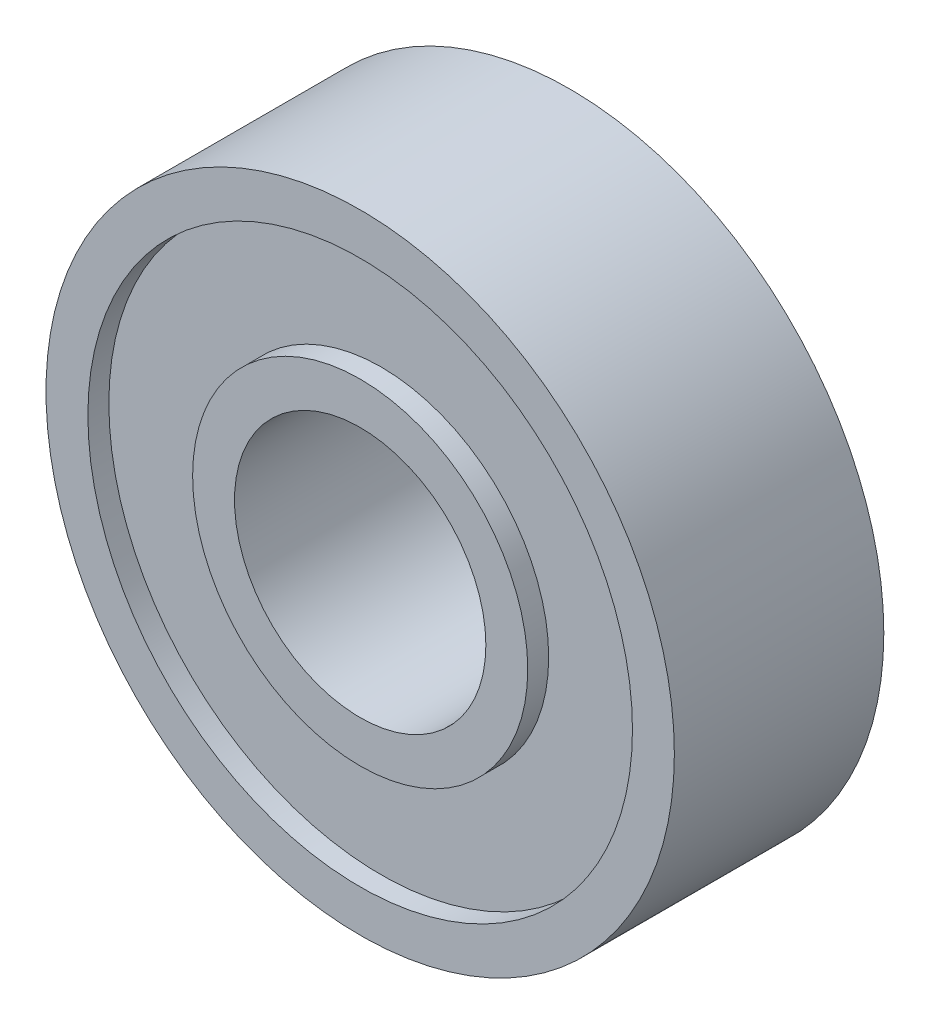
ISO-10303-21;
HEADER;
FILE_DESCRIPTION(('STEP AP214'),'2;1');
FILE_NAME('part.step','',(''),(''),'','','');
FILE_SCHEMA(('AUTOMOTIVE_DESIGN { 1 0 10303 214 1 1 1 1 }'));
ENDSEC;
DATA;
#1=APPLICATION_CONTEXT('core data for automotive mechanical design processes');
#2=APPLICATION_PROTOCOL_DEFINITION('international standard','automotive_design',2000,#1);
#3=PRODUCT_CONTEXT('',#1,'mechanical');
#4=PRODUCT('Part','Part','',(#3));
#5=PRODUCT_RELATED_PRODUCT_CATEGORY('part','',(#4));
#6=PRODUCT_DEFINITION_FORMATION('','',#4);
#7=PRODUCT_DEFINITION_CONTEXT('part definition',#1,'design');
#8=PRODUCT_DEFINITION('design','',#6,#7);
#9=PRODUCT_DEFINITION_SHAPE('','',#8);
#10=(LENGTH_UNIT() NAMED_UNIT(*) SI_UNIT(.MILLI.,.METRE.));
#11=(NAMED_UNIT(*) PLANE_ANGLE_UNIT() SI_UNIT($,.RADIAN.));
#12=(NAMED_UNIT(*) SI_UNIT($,.STERADIAN.) SOLID_ANGLE_UNIT());
#13=UNCERTAINTY_MEASURE_WITH_UNIT(LENGTH_MEASURE(1.E-05),#10,'distance_accuracy_value','');
#14=(GEOMETRIC_REPRESENTATION_CONTEXT(3) GLOBAL_UNCERTAINTY_ASSIGNED_CONTEXT((#13)) GLOBAL_UNIT_ASSIGNED_CONTEXT((#10,
#11,#12)) REPRESENTATION_CONTEXT('',''));
#15=CARTESIAN_POINT('',(0.,0.,0.));
#16=DIRECTION('',(0.,0.,1.));
#17=DIRECTION('',(1.,0.,0.));
#18=AXIS2_PLACEMENT_3D('',#15,#16,#17);
#19=CARTESIAN_POINT('',(0.,0.,0.));
#20=DIRECTION('',(0.,0.,1.));
#21=DIRECTION('',(1.,0.,0.));
#22=AXIS2_PLACEMENT_3D('',#19,#20,#21);
#23=PLANE('',#22);
#24=CARTESIAN_POINT('',(0.,0.,0.));
#25=DIRECTION('',(0.,0.,1.));
#26=DIRECTION('',(1.,0.,0.));
#27=AXIS2_PLACEMENT_3D('',#24,#25,#26);
#28=CIRCLE('',#27,3.);
#29=CARTESIAN_POINT('',(3.,0.,0.));
#30=VERTEX_POINT('',#29);
#31=EDGE_CURVE('E44',#30,#30,#28,.T.);
#32=ORIENTED_EDGE('',*,*,#31,.T.);
#33=EDGE_LOOP('',(#32));
#34=FACE_BOUND('',#33,.T.);
#35=CARTESIAN_POINT('',(0.,0.,0.));
#36=DIRECTION('',(0.,0.,1.));
#37=DIRECTION('',(1.,0.,0.));
#38=AXIS2_PLACEMENT_3D('',#35,#36,#37);
#39=CIRCLE('',#38,4.);
#40=CARTESIAN_POINT('',(4.,0.,0.));
#41=VERTEX_POINT('',#40);
#42=EDGE_CURVE('E68',#41,#41,#39,.T.);
#43=ORIENTED_EDGE('',*,*,#42,.F.);
#44=EDGE_LOOP('',(#43));
#45=FACE_BOUND('',#44,.T.);
#46=ADVANCED_FACE('F31',(#34,#45),#23,.F.);
#47=CARTESIAN_POINT('',(0.,0.,5.));
#48=DIRECTION('',(0.,0.,1.));
#49=DIRECTION('',(1.,0.,0.));
#50=AXIS2_PLACEMENT_3D('',#47,#48,#49);
#51=PLANE('',#50);
#52=CARTESIAN_POINT('',(0.,0.,5.));
#53=DIRECTION('',(0.,0.,1.));
#54=DIRECTION('',(1.,0.,0.));
#55=AXIS2_PLACEMENT_3D('',#52,#53,#54);
#56=CIRCLE('',#55,3.);
#57=CARTESIAN_POINT('',(3.,0.,5.));
#58=VERTEX_POINT('',#57);
#59=EDGE_CURVE('E42',#58,#58,#56,.T.);
#60=ORIENTED_EDGE('',*,*,#59,.F.);
#61=EDGE_LOOP('',(#60));
#62=FACE_BOUND('',#61,.T.);
#63=CARTESIAN_POINT('',(0.,0.,5.));
#64=DIRECTION('',(0.,0.,1.));
#65=DIRECTION('',(1.,0.,0.));
#66=AXIS2_PLACEMENT_3D('',#63,#64,#65);
#67=CIRCLE('',#66,4.);
#68=CARTESIAN_POINT('',(4.,0.,5.));
#69=VERTEX_POINT('',#68);
#70=EDGE_CURVE('E56',#69,#69,#67,.T.);
#71=ORIENTED_EDGE('',*,*,#70,.T.);
#72=EDGE_LOOP('',(#71));
#73=FACE_BOUND('',#72,.T.);
#74=ADVANCED_FACE('F84',(#62,#73),#51,.T.);
#75=CARTESIAN_POINT('',(0.,0.,5.));
#76=DIRECTION('',(0.,0.,1.));
#77=DIRECTION('',(1.,0.,0.));
#78=AXIS2_PLACEMENT_3D('',#75,#76,#77);
#79=CIRCLE('',#78,6.5);
#80=CARTESIAN_POINT('',(6.5,0.,5.));
#81=VERTEX_POINT('',#80);
#82=EDGE_CURVE('E50',#81,#81,#79,.T.);
#83=ORIENTED_EDGE('',*,*,#82,.F.);
#84=EDGE_LOOP('',(#83));
#85=FACE_BOUND('',#84,.T.);
#86=CARTESIAN_POINT('',(0.,0.,5.));
#87=DIRECTION('',(0.,0.,1.));
#88=DIRECTION('',(1.,0.,0.));
#89=AXIS2_PLACEMENT_3D('',#86,#87,#88);
#90=CIRCLE('',#89,7.5);
#91=CARTESIAN_POINT('',(7.5,0.,5.));
#92=VERTEX_POINT('',#91);
#93=EDGE_CURVE('E10',#92,#92,#90,.T.);
#94=ORIENTED_EDGE('',*,*,#93,.T.);
#95=EDGE_LOOP('',(#94));
#96=FACE_BOUND('',#95,.T.);
#97=ADVANCED_FACE('F90',(#85,#96),#51,.T.);
#98=CARTESIAN_POINT('',(0.,0.,0.));
#99=DIRECTION('',(0.,0.,1.));
#100=DIRECTION('',(1.,0.,0.));
#101=AXIS2_PLACEMENT_3D('',#98,#99,#100);
#102=CIRCLE('',#101,6.5);
#103=CARTESIAN_POINT('',(6.5,0.,0.));
#104=VERTEX_POINT('',#103);
#105=EDGE_CURVE('E62',#104,#104,#102,.T.);
#106=ORIENTED_EDGE('',*,*,#105,.T.);
#107=EDGE_LOOP('',(#106));
#108=FACE_BOUND('',#107,.T.);
#109=CARTESIAN_POINT('',(0.,0.,0.));
#110=DIRECTION('',(0.,0.,1.));
#111=DIRECTION('',(1.,0.,0.));
#112=AXIS2_PLACEMENT_3D('',#109,#110,#111);
#113=CIRCLE('',#112,7.5);
#114=CARTESIAN_POINT('',(7.5,0.,0.));
#115=VERTEX_POINT('',#114);
#116=EDGE_CURVE('E35',#115,#115,#113,.T.);
#117=ORIENTED_EDGE('',*,*,#116,.F.);
#118=EDGE_LOOP('',(#117));
#119=FACE_BOUND('',#118,.T.);
#120=ADVANCED_FACE('F86',(#108,#119),#23,.F.);
#121=CARTESIAN_POINT('',(0.,0.,5.));
#122=DIRECTION('',(0.,0.,-1.));
#123=DIRECTION('',(-1.,0.,0.));
#124=AXIS2_PLACEMENT_3D('',#121,#122,#123);
#125=CYLINDRICAL_SURFACE('',#124,7.5);
#126=ORIENTED_EDGE('',*,*,#93,.F.);
#127=EDGE_LOOP('',(#126));
#128=FACE_BOUND('',#127,.T.);
#129=ORIENTED_EDGE('',*,*,#116,.T.);
#130=EDGE_LOOP('',(#129));
#131=FACE_BOUND('',#130,.T.);
#132=ADVANCED_FACE('F33',(#128,#131),#125,.T.);
#133=CARTESIAN_POINT('',(0.,0.,5.));
#134=DIRECTION('',(0.,0.,-1.));
#135=DIRECTION('',(-1.,0.,0.));
#136=AXIS2_PLACEMENT_3D('',#133,#134,#135);
#137=CYLINDRICAL_SURFACE('',#136,3.);
#138=ORIENTED_EDGE('',*,*,#59,.T.);
#139=EDGE_LOOP('',(#138));
#140=FACE_BOUND('',#139,.T.);
#141=ORIENTED_EDGE('',*,*,#31,.F.);
#142=EDGE_LOOP('',(#141));
#143=FACE_BOUND('',#142,.T.);
#144=ADVANCED_FACE('F99',(#140,#143),#137,.F.);
#145=CARTESIAN_POINT('',(0.,0.,4.5));
#146=DIRECTION('',(0.,0.,1.));
#147=DIRECTION('',(1.,0.,0.));
#148=AXIS2_PLACEMENT_3D('',#145,#146,#147);
#149=CYLINDRICAL_SURFACE('',#148,6.5);
#150=CARTESIAN_POINT('',(0.,0.,4.5));
#151=DIRECTION('',(0.,0.,1.));
#152=DIRECTION('',(1.,0.,0.));
#153=AXIS2_PLACEMENT_3D('',#150,#151,#152);
#154=CIRCLE('',#153,6.5);
#155=CARTESIAN_POINT('',(6.5,0.,4.5));
#156=VERTEX_POINT('',#155);
#157=EDGE_CURVE('E47',#156,#156,#154,.T.);
#158=ORIENTED_EDGE('',*,*,#157,.F.);
#159=EDGE_LOOP('',(#158));
#160=FACE_BOUND('',#159,.T.);
#161=ORIENTED_EDGE('',*,*,#82,.T.);
#162=EDGE_LOOP('',(#161));
#163=FACE_BOUND('',#162,.T.);
#164=ADVANCED_FACE('F123',(#160,#163),#149,.F.);
#165=CARTESIAN_POINT('',(0.,0.,4.5));
#166=DIRECTION('',(0.,0.,1.));
#167=DIRECTION('',(1.,0.,0.));
#168=AXIS2_PLACEMENT_3D('',#165,#166,#167);
#169=PLANE('',#168);
#170=CARTESIAN_POINT('',(0.,0.,4.5));
#171=DIRECTION('',(0.,0.,1.));
#172=DIRECTION('',(1.,0.,0.));
#173=AXIS2_PLACEMENT_3D('',#170,#171,#172);
#174=CIRCLE('',#173,4.);
#175=CARTESIAN_POINT('',(4.,0.,4.5));
#176=VERTEX_POINT('',#175);
#177=EDGE_CURVE('E53',#176,#176,#174,.T.);
#178=ORIENTED_EDGE('',*,*,#177,.F.);
#179=EDGE_LOOP('',(#178));
#180=FACE_BOUND('',#179,.T.);
#181=ORIENTED_EDGE('',*,*,#157,.T.);
#182=EDGE_LOOP('',(#181));
#183=FACE_BOUND('',#182,.T.);
#184=ADVANCED_FACE('F119',(#180,#183),#169,.T.);
#185=CARTESIAN_POINT('',(0.,0.,4.5));
#186=DIRECTION('',(0.,0.,1.));
#187=DIRECTION('',(1.,0.,0.));
#188=AXIS2_PLACEMENT_3D('',#185,#186,#187);
#189=CYLINDRICAL_SURFACE('',#188,4.);
#190=ORIENTED_EDGE('',*,*,#177,.T.);
#191=EDGE_LOOP('',(#190));
#192=FACE_BOUND('',#191,.T.);
#193=ORIENTED_EDGE('',*,*,#70,.F.);
#194=EDGE_LOOP('',(#193));
#195=FACE_BOUND('',#194,.T.);
#196=ADVANCED_FACE('F113',(#192,#195),#189,.T.);
#197=CARTESIAN_POINT('',(0.,0.,0.5));
#198=DIRECTION('',(0.,0.,-1.));
#199=DIRECTION('',(1.,0.,0.));
#200=AXIS2_PLACEMENT_3D('',#197,#198,#199);
#201=PLANE('',#200);
#202=CARTESIAN_POINT('',(0.,0.,0.5));
#203=DIRECTION('',(0.,0.,1.));
#204=DIRECTION('',(1.,0.,0.));
#205=AXIS2_PLACEMENT_3D('',#202,#203,#204);
#206=CIRCLE('',#205,6.5);
#207=CARTESIAN_POINT('',(6.5,0.,0.5));
#208=VERTEX_POINT('',#207);
#209=EDGE_CURVE('E59',#208,#208,#206,.T.);
#210=ORIENTED_EDGE('',*,*,#209,.F.);
#211=EDGE_LOOP('',(#210));
#212=FACE_BOUND('',#211,.T.);
#213=CARTESIAN_POINT('',(0.,0.,0.5));
#214=DIRECTION('',(0.,0.,1.));
#215=DIRECTION('',(1.,0.,0.));
#216=AXIS2_PLACEMENT_3D('',#213,#214,#215);
#217=CIRCLE('',#216,4.);
#218=CARTESIAN_POINT('',(4.,0.,0.5));
#219=VERTEX_POINT('',#218);
#220=EDGE_CURVE('E65',#219,#219,#217,.T.);
#221=ORIENTED_EDGE('',*,*,#220,.T.);
#222=EDGE_LOOP('',(#221));
#223=FACE_BOUND('',#222,.T.);
#224=ADVANCED_FACE('F74',(#212,#223),#201,.T.);
#225=CARTESIAN_POINT('',(0.,0.,0.5));
#226=DIRECTION('',(0.,0.,-1.));
#227=DIRECTION('',(-1.,0.,0.));
#228=AXIS2_PLACEMENT_3D('',#225,#226,#227);
#229=CYLINDRICAL_SURFACE('',#228,6.5);
#230=ORIENTED_EDGE('',*,*,#209,.T.);
#231=EDGE_LOOP('',(#230));
#232=FACE_BOUND('',#231,.T.);
#233=ORIENTED_EDGE('',*,*,#105,.F.);
#234=EDGE_LOOP('',(#233));
#235=FACE_BOUND('',#234,.T.);
#236=ADVANCED_FACE('F79',(#232,#235),#229,.F.);
#237=CARTESIAN_POINT('',(0.,0.,0.5));
#238=DIRECTION('',(0.,0.,-1.));
#239=DIRECTION('',(-1.,0.,0.));
#240=AXIS2_PLACEMENT_3D('',#237,#238,#239);
#241=CYLINDRICAL_SURFACE('',#240,4.);
#242=ORIENTED_EDGE('',*,*,#220,.F.);
#243=EDGE_LOOP('',(#242));
#244=FACE_BOUND('',#243,.T.);
#245=ORIENTED_EDGE('',*,*,#42,.T.);
#246=EDGE_LOOP('',(#245));
#247=FACE_BOUND('',#246,.T.);
#248=ADVANCED_FACE('F76',(#244,#247),#241,.T.);
#249=CLOSED_SHELL('',(#46,#74,#97,#120,#132,#144,#164,#184,#196,#224,#236,#248));
#250=MANIFOLD_SOLID_BREP('B2',#249);
#251=ADVANCED_BREP_SHAPE_REPRESENTATION('',(#18,#250),#14);
#252=SHAPE_DEFINITION_REPRESENTATION(#9,#251);
ENDSEC;
END-ISO-10303-21;
